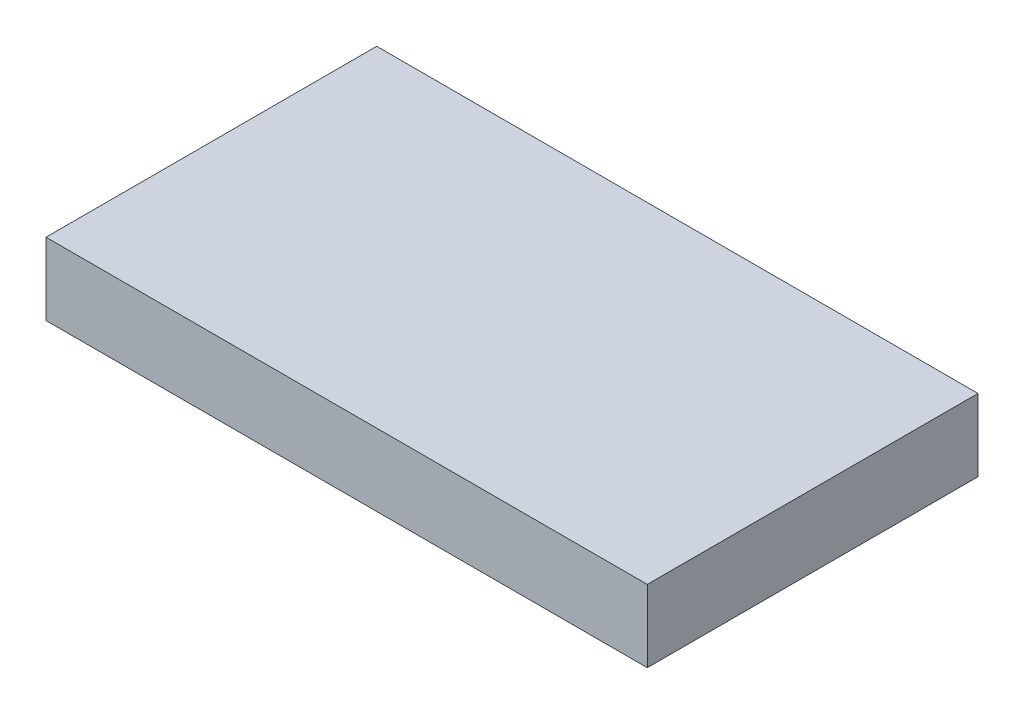
ISO-10303-21;
HEADER;
FILE_DESCRIPTION(('STEP AP214'),'2;1');
FILE_NAME('part.step','',(''),(''),'','','');
FILE_SCHEMA(('AUTOMOTIVE_DESIGN { 1 0 10303 214 1 1 1 1 }'));
ENDSEC;
DATA;
#1=APPLICATION_CONTEXT('core data for automotive mechanical design processes');
#2=APPLICATION_PROTOCOL_DEFINITION('international standard','automotive_design',2000,#1);
#3=PRODUCT_CONTEXT('',#1,'mechanical');
#4=PRODUCT('Part','Part','',(#3));
#5=PRODUCT_RELATED_PRODUCT_CATEGORY('part','',(#4));
#6=PRODUCT_DEFINITION_FORMATION('','',#4);
#7=PRODUCT_DEFINITION_CONTEXT('part definition',#1,'design');
#8=PRODUCT_DEFINITION('design','',#6,#7);
#9=PRODUCT_DEFINITION_SHAPE('','',#8);
#10=(LENGTH_UNIT() NAMED_UNIT(*) SI_UNIT(.MILLI.,.METRE.));
#11=(NAMED_UNIT(*) PLANE_ANGLE_UNIT() SI_UNIT($,.RADIAN.));
#12=(NAMED_UNIT(*) SI_UNIT($,.STERADIAN.) SOLID_ANGLE_UNIT());
#13=UNCERTAINTY_MEASURE_WITH_UNIT(LENGTH_MEASURE(1.E-05),#10,'distance_accuracy_value','');
#14=(GEOMETRIC_REPRESENTATION_CONTEXT(3) GLOBAL_UNCERTAINTY_ASSIGNED_CONTEXT((#13)) GLOBAL_UNIT_ASSIGNED_CONTEXT((#10,
#11,#12)) REPRESENTATION_CONTEXT('',''));
#15=CARTESIAN_POINT('',(0.,0.,0.));
#16=DIRECTION('',(0.,0.,1.));
#17=DIRECTION('',(1.,0.,0.));
#18=AXIS2_PLACEMENT_3D('',#15,#16,#17);
#19=CARTESIAN_POINT('',(0.,12.,0.));
#20=DIRECTION('',(1.,0.,0.));
#21=DIRECTION('',(0.,0.,-1.));
#22=AXIS2_PLACEMENT_3D('',#19,#20,#21);
#23=PLANE('',#22);
#24=DIRECTION('',(0.,0.,1.));
#25=VECTOR('',#24,1.);
#26=CARTESIAN_POINT('',(0.,0.,0.));
#27=LINE('',#26,#25);
#28=CARTESIAN_POINT('',(0.,0.,-55.));
#29=VERTEX_POINT('',#28);
#30=CARTESIAN_POINT('',(0.,0.,0.));
#31=VERTEX_POINT('',#30);
#32=EDGE_CURVE('E99',#29,#31,#27,.T.);
#33=ORIENTED_EDGE('',*,*,#32,.T.);
#34=DIRECTION('',(0.,-1.,0.));
#35=VECTOR('',#34,1.);
#36=CARTESIAN_POINT('',(0.,12.,0.));
#37=LINE('',#36,#35);
#38=CARTESIAN_POINT('',(0.,12.,0.));
#39=VERTEX_POINT('',#38);
#40=EDGE_CURVE('E11',#39,#31,#37,.T.);
#41=ORIENTED_EDGE('',*,*,#40,.F.);
#42=DIRECTION('',(0.,0.,1.));
#43=VECTOR('',#42,1.);
#44=CARTESIAN_POINT('',(0.,12.,0.));
#45=LINE('',#44,#43);
#46=CARTESIAN_POINT('',(0.,12.,-55.));
#47=VERTEX_POINT('',#46);
#48=EDGE_CURVE('E87',#47,#39,#45,.T.);
#49=ORIENTED_EDGE('',*,*,#48,.F.);
#50=DIRECTION('',(0.,-1.,0.));
#51=VECTOR('',#50,1.);
#52=CARTESIAN_POINT('',(0.,12.,-55.));
#53=LINE('',#52,#51);
#54=EDGE_CURVE('E95',#47,#29,#53,.T.);
#55=ORIENTED_EDGE('',*,*,#54,.T.);
#56=EDGE_LOOP('',(#33,#41,#49,#55));
#57=FACE_BOUND('',#56,.T.);
#58=ADVANCED_FACE('F36',(#57),#23,.F.);
#59=CARTESIAN_POINT('',(0.,12.,0.));
#60=DIRECTION('',(0.,0.,-1.));
#61=DIRECTION('',(-1.,0.,0.));
#62=AXIS2_PLACEMENT_3D('',#59,#60,#61);
#63=PLANE('',#62);
#64=DIRECTION('',(1.,0.,0.));
#65=VECTOR('',#64,1.);
#66=CARTESIAN_POINT('',(0.,0.,0.));
#67=LINE('',#66,#65);
#68=CARTESIAN_POINT('',(100.,0.,0.));
#69=VERTEX_POINT('',#68);
#70=EDGE_CURVE('E91',#31,#69,#67,.T.);
#71=ORIENTED_EDGE('',*,*,#70,.T.);
#72=DIRECTION('',(0.,-1.,0.));
#73=VECTOR('',#72,1.);
#74=CARTESIAN_POINT('',(100.,12.,0.));
#75=LINE('',#74,#73);
#76=CARTESIAN_POINT('',(100.,12.,0.));
#77=VERTEX_POINT('',#76);
#78=EDGE_CURVE('E44',#77,#69,#75,.T.);
#79=ORIENTED_EDGE('',*,*,#78,.F.);
#80=DIRECTION('',(1.,0.,0.));
#81=VECTOR('',#80,1.);
#82=CARTESIAN_POINT('',(0.,12.,0.));
#83=LINE('',#82,#81);
#84=EDGE_CURVE('E82',#39,#77,#83,.T.);
#85=ORIENTED_EDGE('',*,*,#84,.F.);
#86=ORIENTED_EDGE('',*,*,#40,.T.);
#87=EDGE_LOOP('',(#71,#79,#85,#86));
#88=FACE_BOUND('',#87,.T.);
#89=ADVANCED_FACE('F90',(#88),#63,.F.);
#90=CARTESIAN_POINT('',(100.,12.,0.));
#91=DIRECTION('',(-1.,0.,0.));
#92=DIRECTION('',(0.,0.,1.));
#93=AXIS2_PLACEMENT_3D('',#90,#91,#92);
#94=PLANE('',#93);
#95=DIRECTION('',(0.,0.,-1.));
#96=VECTOR('',#95,1.);
#97=CARTESIAN_POINT('',(100.,0.,0.));
#98=LINE('',#97,#96);
#99=CARTESIAN_POINT('',(100.,0.,-55.));
#100=VERTEX_POINT('',#99);
#101=EDGE_CURVE('E69',#69,#100,#98,.T.);
#102=ORIENTED_EDGE('',*,*,#101,.T.);
#103=DIRECTION('',(0.,-1.,0.));
#104=VECTOR('',#103,1.);
#105=CARTESIAN_POINT('',(100.,12.,-55.));
#106=LINE('',#105,#104);
#107=CARTESIAN_POINT('',(100.,12.,-55.));
#108=VERTEX_POINT('',#107);
#109=EDGE_CURVE('E92',#108,#100,#106,.T.);
#110=ORIENTED_EDGE('',*,*,#109,.F.);
#111=DIRECTION('',(0.,0.,-1.));
#112=VECTOR('',#111,1.);
#113=CARTESIAN_POINT('',(100.,12.,0.));
#114=LINE('',#113,#112);
#115=EDGE_CURVE('E85',#77,#108,#114,.T.);
#116=ORIENTED_EDGE('',*,*,#115,.F.);
#117=ORIENTED_EDGE('',*,*,#78,.T.);
#118=EDGE_LOOP('',(#102,#110,#116,#117));
#119=FACE_BOUND('',#118,.T.);
#120=ADVANCED_FACE('F93',(#119),#94,.F.);
#121=CARTESIAN_POINT('',(0.,12.,-55.));
#122=DIRECTION('',(0.,0.,1.));
#123=DIRECTION('',(1.,0.,0.));
#124=AXIS2_PLACEMENT_3D('',#121,#122,#123);
#125=PLANE('',#124);
#126=DIRECTION('',(-1.,0.,0.));
#127=VECTOR('',#126,1.);
#128=CARTESIAN_POINT('',(0.,0.,-55.));
#129=LINE('',#128,#127);
#130=EDGE_CURVE('E75',#100,#29,#129,.T.);
#131=ORIENTED_EDGE('',*,*,#130,.T.);
#132=ORIENTED_EDGE('',*,*,#54,.F.);
#133=DIRECTION('',(-1.,0.,0.));
#134=VECTOR('',#133,1.);
#135=CARTESIAN_POINT('',(0.,12.,-55.));
#136=LINE('',#135,#134);
#137=EDGE_CURVE('E52',#108,#47,#136,.T.);
#138=ORIENTED_EDGE('',*,*,#137,.F.);
#139=ORIENTED_EDGE('',*,*,#109,.T.);
#140=EDGE_LOOP('',(#131,#132,#138,#139));
#141=FACE_BOUND('',#140,.T.);
#142=ADVANCED_FACE('F106',(#141),#125,.F.);
#143=CARTESIAN_POINT('',(0.,12.,-55.));
#144=DIRECTION('',(0.,-1.,0.));
#145=DIRECTION('',(0.,0.,-1.));
#146=AXIS2_PLACEMENT_3D('',#143,#144,#145);
#147=PLANE('',#146);
#148=ORIENTED_EDGE('',*,*,#48,.T.);
#149=ORIENTED_EDGE('',*,*,#84,.T.);
#150=ORIENTED_EDGE('',*,*,#115,.T.);
#151=ORIENTED_EDGE('',*,*,#137,.T.);
#152=EDGE_LOOP('',(#148,#149,#150,#151));
#153=FACE_BOUND('',#152,.T.);
#154=ADVANCED_FACE('F83',(#153),#147,.F.);
#155=CARTESIAN_POINT('',(0.,0.,-55.));
#156=DIRECTION('',(0.,-1.,0.));
#157=DIRECTION('',(0.,0.,-1.));
#158=AXIS2_PLACEMENT_3D('',#155,#156,#157);
#159=PLANE('',#158);
#160=ORIENTED_EDGE('',*,*,#32,.F.);
#161=ORIENTED_EDGE('',*,*,#130,.F.);
#162=ORIENTED_EDGE('',*,*,#101,.F.);
#163=ORIENTED_EDGE('',*,*,#70,.F.);
#164=EDGE_LOOP('',(#160,#161,#162,#163));
#165=FACE_BOUND('',#164,.T.);
#166=ADVANCED_FACE('F109',(#165),#159,.T.);
#167=CLOSED_SHELL('',(#58,#89,#120,#142,#154,#166));
#168=MANIFOLD_SOLID_BREP('B2',#167);
#169=ADVANCED_BREP_SHAPE_REPRESENTATION('',(#18,#168),#14);
#170=SHAPE_DEFINITION_REPRESENTATION(#9,#169);
ENDSEC;
END-ISO-10303-21;
